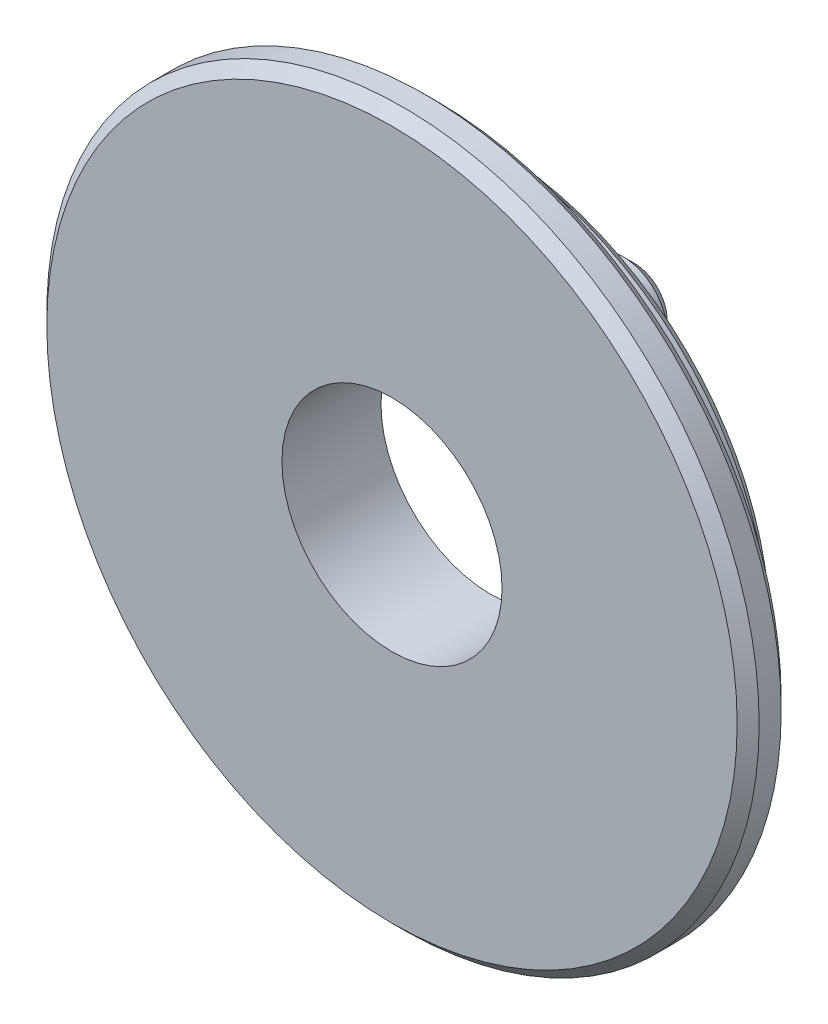
ISO-10303-21;
HEADER;
FILE_DESCRIPTION(('STEP AP214'),'2;1');
FILE_NAME('part.step','',(''),(''),'','','');
FILE_SCHEMA(('AUTOMOTIVE_DESIGN { 1 0 10303 214 1 1 1 1 }'));
ENDSEC;
DATA;
#1=APPLICATION_CONTEXT('core data for automotive mechanical design processes');
#2=APPLICATION_PROTOCOL_DEFINITION('international standard','automotive_design',2000,#1);
#3=PRODUCT_CONTEXT('',#1,'mechanical');
#4=PRODUCT('Part','Part','',(#3));
#5=PRODUCT_RELATED_PRODUCT_CATEGORY('part','',(#4));
#6=PRODUCT_DEFINITION_FORMATION('','',#4);
#7=PRODUCT_DEFINITION_CONTEXT('part definition',#1,'design');
#8=PRODUCT_DEFINITION('design','',#6,#7);
#9=PRODUCT_DEFINITION_SHAPE('','',#8);
#10=(LENGTH_UNIT() NAMED_UNIT(*) SI_UNIT(.MILLI.,.METRE.));
#11=(NAMED_UNIT(*) PLANE_ANGLE_UNIT() SI_UNIT($,.RADIAN.));
#12=(NAMED_UNIT(*) SI_UNIT($,.STERADIAN.) SOLID_ANGLE_UNIT());
#13=UNCERTAINTY_MEASURE_WITH_UNIT(LENGTH_MEASURE(1.E-05),#10,'distance_accuracy_value','');
#14=(GEOMETRIC_REPRESENTATION_CONTEXT(3) GLOBAL_UNCERTAINTY_ASSIGNED_CONTEXT((#13)) GLOBAL_UNIT_ASSIGNED_CONTEXT((#10,
#11,#12)) REPRESENTATION_CONTEXT('',''));
#15=CARTESIAN_POINT('',(0.,0.,0.));
#16=DIRECTION('',(0.,0.,1.));
#17=DIRECTION('',(1.,0.,0.));
#18=AXIS2_PLACEMENT_3D('',#15,#16,#17);
#19=CARTESIAN_POINT('',(0.,0.,-2.25));
#20=DIRECTION('',(0.,0.,-1.));
#21=DIRECTION('',(-1.,0.,0.));
#22=AXIS2_PLACEMENT_3D('',#19,#20,#21);
#23=PLANE('',#22);
#24=CARTESIAN_POINT('',(0.,0.,-2.25));
#25=DIRECTION('',(0.,0.,-1.));
#26=DIRECTION('',(-1.,0.,0.));
#27=AXIS2_PLACEMENT_3D('',#24,#25,#26);
#28=CIRCLE('',#27,6.33);
#29=CARTESIAN_POINT('',(-6.33,0.,-2.25));
#30=VERTEX_POINT('',#29);
#31=EDGE_CURVE('E10',#30,#30,#28,.T.);
#32=ORIENTED_EDGE('',*,*,#31,.T.);
#33=EDGE_LOOP('',(#32));
#34=FACE_BOUND('',#33,.T.);
#35=CARTESIAN_POINT('',(2.25000000000002,3.89711431702996,-2.25));
#36=DIRECTION('',(0.,0.,-1.));
#37=DIRECTION('',(1.,0.,0.));
#38=AXIS2_PLACEMENT_3D('',#35,#36,#37);
#39=CIRCLE('',#38,1.);
#40=CARTESIAN_POINT('',(3.25000000000002,3.89711431702996,-2.25));
#41=VERTEX_POINT('',#40);
#42=EDGE_CURVE('E85',#41,#41,#39,.T.);
#43=ORIENTED_EDGE('',*,*,#42,.F.);
#44=EDGE_LOOP('',(#43));
#45=FACE_BOUND('',#44,.T.);
#46=CARTESIAN_POINT('',(0.,0.,-2.25));
#47=DIRECTION('',(0.,0.,-1.));
#48=DIRECTION('',(-1.,0.,0.));
#49=AXIS2_PLACEMENT_3D('',#46,#47,#48);
#50=CIRCLE('',#49,2.5);
#51=CARTESIAN_POINT('',(-2.5,0.,-2.25));
#52=VERTEX_POINT('',#51);
#53=EDGE_CURVE('E76',#52,#52,#50,.T.);
#54=ORIENTED_EDGE('',*,*,#53,.F.);
#55=EDGE_LOOP('',(#54));
#56=FACE_BOUND('',#55,.T.);
#57=CARTESIAN_POINT('',(-4.5,0.,-2.25));
#58=DIRECTION('',(0.,0.,-1.));
#59=DIRECTION('',(-1.,0.,0.));
#60=AXIS2_PLACEMENT_3D('',#57,#58,#59);
#61=CIRCLE('',#60,1.);
#62=CARTESIAN_POINT('',(-5.5,0.,-2.25));
#63=VERTEX_POINT('',#62);
#64=EDGE_CURVE('E82',#63,#63,#61,.T.);
#65=ORIENTED_EDGE('',*,*,#64,.F.);
#66=EDGE_LOOP('',(#65));
#67=FACE_BOUND('',#66,.T.);
#68=CARTESIAN_POINT('',(2.25000000000002,-3.89711431702996,-2.25));
#69=DIRECTION('',(0.,0.,-1.));
#70=DIRECTION('',(-1.,0.,0.));
#71=AXIS2_PLACEMENT_3D('',#68,#69,#70);
#72=CIRCLE('',#71,1.);
#73=CARTESIAN_POINT('',(1.25000000000002,-3.89711431702996,-2.25));
#74=VERTEX_POINT('',#73);
#75=EDGE_CURVE('E88',#74,#74,#72,.T.);
#76=ORIENTED_EDGE('',*,*,#75,.F.);
#77=EDGE_LOOP('',(#76));
#78=FACE_BOUND('',#77,.T.);
#79=ADVANCED_FACE('F29',(#34,#45,#56,#67,#78),#23,.T.);
#80=CARTESIAN_POINT('',(0.,0.,17.8725165562914));
#81=DIRECTION('',(0.,0.,1.));
#82=DIRECTION('',(1.,0.,0.));
#83=AXIS2_PLACEMENT_3D('',#80,#81,#82);
#84=CYLINDRICAL_SURFACE('',#83,8.09);
#85=CARTESIAN_POINT('',(0.,0.,-0.250000000000007));
#86=DIRECTION('',(0.,0.,1.));
#87=DIRECTION('',(1.,0.,0.));
#88=AXIS2_PLACEMENT_3D('',#85,#86,#87);
#89=CIRCLE('',#88,8.09);
#90=CARTESIAN_POINT('',(8.09,0.,-0.250000000000007));
#91=VERTEX_POINT('',#90);
#92=EDGE_CURVE('E44',#91,#91,#89,.F.);
#93=ORIENTED_EDGE('',*,*,#92,.T.);
#94=EDGE_LOOP('',(#93));
#95=FACE_BOUND('',#94,.T.);
#96=CARTESIAN_POINT('',(0.,0.,-0.750000000000001));
#97=DIRECTION('',(0.,0.,-1.));
#98=DIRECTION('',(-1.,0.,0.));
#99=AXIS2_PLACEMENT_3D('',#96,#97,#98);
#100=CIRCLE('',#99,8.09);
#101=CARTESIAN_POINT('',(-8.09,0.,-0.750000000000001));
#102=VERTEX_POINT('',#101);
#103=EDGE_CURVE('E49',#102,#102,#100,.F.);
#104=ORIENTED_EDGE('',*,*,#103,.T.);
#105=EDGE_LOOP('',(#104));
#106=FACE_BOUND('',#105,.T.);
#107=ADVANCED_FACE('F95',(#95,#106),#84,.T.);
#108=CARTESIAN_POINT('',(8.09,0.,-1.));
#109=DIRECTION('',(0.,0.,-1.));
#110=DIRECTION('',(-1.,0.,0.));
#111=AXIS2_PLACEMENT_3D('',#108,#109,#110);
#112=PLANE('',#111);
#113=CARTESIAN_POINT('',(0.,0.,-1.));
#114=DIRECTION('',(0.,0.,-1.));
#115=DIRECTION('',(-1.,0.,0.));
#116=AXIS2_PLACEMENT_3D('',#113,#114,#115);
#117=CIRCLE('',#116,7.84);
#118=CARTESIAN_POINT('',(-7.84,0.,-1.));
#119=VERTEX_POINT('',#118);
#120=EDGE_CURVE('E40',#119,#119,#117,.T.);
#121=ORIENTED_EDGE('',*,*,#120,.T.);
#122=EDGE_LOOP('',(#121));
#123=FACE_BOUND('',#122,.T.);
#124=CARTESIAN_POINT('',(0.,0.,-1.));
#125=DIRECTION('',(0.,0.,1.));
#126=DIRECTION('',(1.,0.,0.));
#127=AXIS2_PLACEMENT_3D('',#124,#125,#126);
#128=CIRCLE('',#127,6.58);
#129=CARTESIAN_POINT('',(6.58,0.,-1.));
#130=VERTEX_POINT('',#129);
#131=EDGE_CURVE('E73',#130,#130,#128,.T.);
#132=ORIENTED_EDGE('',*,*,#131,.T.);
#133=EDGE_LOOP('',(#132));
#134=FACE_BOUND('',#133,.T.);
#135=ADVANCED_FACE('F100',(#123,#134),#112,.T.);
#136=CARTESIAN_POINT('',(0.,0.,17.8725165562914));
#137=DIRECTION('',(0.,0.,1.));
#138=DIRECTION('',(1.,0.,0.));
#139=AXIS2_PLACEMENT_3D('',#136,#137,#138);
#140=CYLINDRICAL_SURFACE('',#139,6.58);
#141=CARTESIAN_POINT('',(0.,0.,-1.99999999999999));
#142=DIRECTION('',(0.,0.,-1.));
#143=DIRECTION('',(-1.,0.,0.));
#144=AXIS2_PLACEMENT_3D('',#141,#142,#143);
#145=CIRCLE('',#144,6.58);
#146=CARTESIAN_POINT('',(-6.58,0.,-1.99999999999999));
#147=VERTEX_POINT('',#146);
#148=EDGE_CURVE('E36',#147,#147,#145,.F.);
#149=ORIENTED_EDGE('',*,*,#148,.T.);
#150=EDGE_LOOP('',(#149));
#151=FACE_BOUND('',#150,.T.);
#152=ORIENTED_EDGE('',*,*,#131,.F.);
#153=EDGE_LOOP('',(#152));
#154=FACE_BOUND('',#153,.T.);
#155=ADVANCED_FACE('F108',(#151,#154),#140,.T.);
#156=CARTESIAN_POINT('',(8.09,0.,0.));
#157=DIRECTION('',(0.,0.,1.));
#158=DIRECTION('',(1.,0.,0.));
#159=AXIS2_PLACEMENT_3D('',#156,#157,#158);
#160=PLANE('',#159);
#161=CARTESIAN_POINT('',(0.,0.,0.));
#162=DIRECTION('',(0.,0.,1.));
#163=DIRECTION('',(1.,0.,0.));
#164=AXIS2_PLACEMENT_3D('',#161,#162,#163);
#165=CIRCLE('',#164,7.84);
#166=CARTESIAN_POINT('',(7.84,0.,0.));
#167=VERTEX_POINT('',#166);
#168=EDGE_CURVE('E52',#167,#167,#165,.T.);
#169=ORIENTED_EDGE('',*,*,#168,.T.);
#170=EDGE_LOOP('',(#169));
#171=FACE_BOUND('',#170,.T.);
#172=CARTESIAN_POINT('',(0.,0.,0.));
#173=DIRECTION('',(0.,0.,1.));
#174=DIRECTION('',(1.,0.,0.));
#175=AXIS2_PLACEMENT_3D('',#172,#173,#174);
#176=CIRCLE('',#175,2.5);
#177=CARTESIAN_POINT('',(2.5,0.,0.));
#178=VERTEX_POINT('',#177);
#179=EDGE_CURVE('E79',#178,#178,#176,.T.);
#180=ORIENTED_EDGE('',*,*,#179,.F.);
#181=EDGE_LOOP('',(#180));
#182=FACE_BOUND('',#181,.T.);
#183=ADVANCED_FACE('F106',(#171,#182),#160,.T.);
#184=CARTESIAN_POINT('',(0.,0.,0.));
#185=DIRECTION('',(0.,0.,1.));
#186=DIRECTION('',(1.,0.,0.));
#187=AXIS2_PLACEMENT_3D('',#184,#185,#186);
#188=CYLINDRICAL_SURFACE('',#187,2.5);
#189=ORIENTED_EDGE('',*,*,#53,.T.);
#190=EDGE_LOOP('',(#189));
#191=FACE_BOUND('',#190,.T.);
#192=ORIENTED_EDGE('',*,*,#179,.T.);
#193=EDGE_LOOP('',(#192));
#194=FACE_BOUND('',#193,.T.);
#195=ADVANCED_FACE('F233',(#191,#194),#188,.F.);
#196=CARTESIAN_POINT('',(-4.5,0.,-3.25));
#197=DIRECTION('',(0.,0.,1.));
#198=DIRECTION('',(1.,0.,0.));
#199=AXIS2_PLACEMENT_3D('',#196,#197,#198);
#200=CYLINDRICAL_SURFACE('',#199,1.);
#201=CARTESIAN_POINT('',(-4.5,0.,-3.));
#202=DIRECTION('',(0.,0.,-1.));
#203=DIRECTION('',(-1.,0.,0.));
#204=AXIS2_PLACEMENT_3D('',#201,#202,#203);
#205=CIRCLE('',#204,1.);
#206=CARTESIAN_POINT('',(-5.5,0.,-3.));
#207=VERTEX_POINT('',#206);
#208=EDGE_CURVE('E67',#207,#207,#205,.F.);
#209=ORIENTED_EDGE('',*,*,#208,.T.);
#210=EDGE_LOOP('',(#209));
#211=FACE_BOUND('',#210,.T.);
#212=ORIENTED_EDGE('',*,*,#64,.T.);
#213=EDGE_LOOP('',(#212));
#214=FACE_BOUND('',#213,.T.);
#215=ADVANCED_FACE('F223',(#211,#214),#200,.T.);
#216=CARTESIAN_POINT('',(-4.5,0.,-3.25));
#217=DIRECTION('',(0.,0.,-1.));
#218=DIRECTION('',(-1.,0.,0.));
#219=AXIS2_PLACEMENT_3D('',#216,#217,#218);
#220=PLANE('',#219);
#221=CARTESIAN_POINT('',(-4.5,0.,-3.25));
#222=DIRECTION('',(0.,0.,-1.));
#223=DIRECTION('',(-1.,0.,0.));
#224=AXIS2_PLACEMENT_3D('',#221,#222,#223);
#225=CIRCLE('',#224,0.750000000000001);
#226=CARTESIAN_POINT('',(-5.25,0.,-3.25));
#227=VERTEX_POINT('',#226);
#228=EDGE_CURVE('E70',#227,#227,#225,.T.);
#229=ORIENTED_EDGE('',*,*,#228,.T.);
#230=EDGE_LOOP('',(#229));
#231=FACE_BOUND('',#230,.T.);
#232=ADVANCED_FACE('F213',(#231),#220,.T.);
#233=CARTESIAN_POINT('',(2.25000000000002,3.89711431702996,-3.25));
#234=DIRECTION('',(0.,0.,1.));
#235=DIRECTION('',(1.,0.,0.));
#236=AXIS2_PLACEMENT_3D('',#233,#234,#235);
#237=CYLINDRICAL_SURFACE('',#236,1.);
#238=CARTESIAN_POINT('',(2.25000000000002,3.89711431702996,-3.));
#239=DIRECTION('',(0.,0.,1.));
#240=DIRECTION('',(1.,0.,0.));
#241=AXIS2_PLACEMENT_3D('',#238,#239,#240);
#242=CIRCLE('',#241,1.);
#243=CARTESIAN_POINT('',(3.25000000000002,3.89711431702996,-3.));
#244=VERTEX_POINT('',#243);
#245=EDGE_CURVE('E55',#244,#244,#242,.T.);
#246=ORIENTED_EDGE('',*,*,#245,.T.);
#247=EDGE_LOOP('',(#246));
#248=FACE_BOUND('',#247,.T.);
#249=ORIENTED_EDGE('',*,*,#42,.T.);
#250=EDGE_LOOP('',(#249));
#251=FACE_BOUND('',#250,.T.);
#252=ADVANCED_FACE('F203',(#248,#251),#237,.T.);
#253=CARTESIAN_POINT('',(2.25000000000002,3.89711431702996,-3.25));
#254=DIRECTION('',(0.,0.,1.));
#255=DIRECTION('',(1.,0.,0.));
#256=AXIS2_PLACEMENT_3D('',#253,#254,#255);
#257=PLANE('',#256);
#258=CARTESIAN_POINT('',(2.25000000000002,3.89711431702996,-3.25));
#259=DIRECTION('',(0.,0.,1.));
#260=DIRECTION('',(1.,0.,0.));
#261=AXIS2_PLACEMENT_3D('',#258,#259,#260);
#262=CIRCLE('',#261,0.749999999999997);
#263=CARTESIAN_POINT('',(3.00000000000002,3.89711431702996,-3.25));
#264=VERTEX_POINT('',#263);
#265=EDGE_CURVE('E58',#264,#264,#262,.F.);
#266=ORIENTED_EDGE('',*,*,#265,.T.);
#267=EDGE_LOOP('',(#266));
#268=FACE_BOUND('',#267,.T.);
#269=ADVANCED_FACE('F193',(#268),#257,.F.);
#270=CARTESIAN_POINT('',(2.25000000000002,-3.89711431702996,-3.25));
#271=DIRECTION('',(0.,0.,1.));
#272=DIRECTION('',(1.,0.,0.));
#273=AXIS2_PLACEMENT_3D('',#270,#271,#272);
#274=CYLINDRICAL_SURFACE('',#273,1.);
#275=CARTESIAN_POINT('',(2.25000000000002,-3.89711431702996,-3.));
#276=DIRECTION('',(0.,0.,-1.));
#277=DIRECTION('',(-1.,0.,0.));
#278=AXIS2_PLACEMENT_3D('',#275,#276,#277);
#279=CIRCLE('',#278,1.);
#280=CARTESIAN_POINT('',(1.25000000000002,-3.89711431702996,-3.));
#281=VERTEX_POINT('',#280);
#282=EDGE_CURVE('E61',#281,#281,#279,.F.);
#283=ORIENTED_EDGE('',*,*,#282,.T.);
#284=EDGE_LOOP('',(#283));
#285=FACE_BOUND('',#284,.T.);
#286=ORIENTED_EDGE('',*,*,#75,.T.);
#287=EDGE_LOOP('',(#286));
#288=FACE_BOUND('',#287,.T.);
#289=ADVANCED_FACE('F92',(#285,#288),#274,.T.);
#290=CARTESIAN_POINT('',(2.25000000000002,-3.89711431702996,-3.25));
#291=DIRECTION('',(0.,0.,-1.));
#292=DIRECTION('',(-1.,0.,0.));
#293=AXIS2_PLACEMENT_3D('',#290,#291,#292);
#294=PLANE('',#293);
#295=CARTESIAN_POINT('',(2.25000000000002,-3.89711431702996,-3.25));
#296=DIRECTION('',(0.,0.,-1.));
#297=DIRECTION('',(-1.,0.,0.));
#298=AXIS2_PLACEMENT_3D('',#295,#296,#297);
#299=CIRCLE('',#298,0.750000000000001);
#300=CARTESIAN_POINT('',(1.50000000000002,-3.89711431702996,-3.25));
#301=VERTEX_POINT('',#300);
#302=EDGE_CURVE('E64',#301,#301,#299,.T.);
#303=ORIENTED_EDGE('',*,*,#302,.T.);
#304=EDGE_LOOP('',(#303));
#305=FACE_BOUND('',#304,.T.);
#306=ADVANCED_FACE('F118',(#305),#294,.T.);
#307=CARTESIAN_POINT('',(-4.5,0.,-3.25));
#308=DIRECTION('',(0.,0.,1.));
#309=DIRECTION('',(1.,0.,0.));
#310=AXIS2_PLACEMENT_3D('',#307,#308,#309);
#311=CONICAL_SURFACE('',#310,0.750000000000001,0.785398163397449);
#312=ORIENTED_EDGE('',*,*,#208,.F.);
#313=EDGE_LOOP('',(#312));
#314=FACE_BOUND('',#313,.T.);
#315=ORIENTED_EDGE('',*,*,#228,.F.);
#316=EDGE_LOOP('',(#315));
#317=FACE_BOUND('',#316,.T.);
#318=ADVANCED_FACE('F114',(#314,#317),#311,.T.);
#319=CARTESIAN_POINT('',(2.25000000000002,-3.89711431702996,-3.25));
#320=DIRECTION('',(0.,0.,1.));
#321=DIRECTION('',(1.,0.,0.));
#322=AXIS2_PLACEMENT_3D('',#319,#320,#321);
#323=CONICAL_SURFACE('',#322,0.750000000000001,0.785398163397449);
#324=ORIENTED_EDGE('',*,*,#282,.F.);
#325=EDGE_LOOP('',(#324));
#326=FACE_BOUND('',#325,.T.);
#327=ORIENTED_EDGE('',*,*,#302,.F.);
#328=EDGE_LOOP('',(#327));
#329=FACE_BOUND('',#328,.T.);
#330=ADVANCED_FACE('F117',(#326,#329),#323,.T.);
#331=CARTESIAN_POINT('',(2.25000000000002,3.89711431702996,-3.25));
#332=DIRECTION('',(0.,0.,1.));
#333=DIRECTION('',(1.,0.,0.));
#334=AXIS2_PLACEMENT_3D('',#331,#332,#333);
#335=CONICAL_SURFACE('',#334,0.749999999999997,0.785398163397449);
#336=ORIENTED_EDGE('',*,*,#245,.F.);
#337=EDGE_LOOP('',(#336));
#338=FACE_BOUND('',#337,.T.);
#339=ORIENTED_EDGE('',*,*,#265,.F.);
#340=EDGE_LOOP('',(#339));
#341=FACE_BOUND('',#340,.T.);
#342=ADVANCED_FACE('F122',(#338,#341),#335,.T.);
#343=CARTESIAN_POINT('',(0.,0.,0.));
#344=DIRECTION('',(0.,0.,-1.));
#345=DIRECTION('',(-1.,0.,0.));
#346=AXIS2_PLACEMENT_3D('',#343,#344,#345);
#347=CONICAL_SURFACE('',#346,7.84,0.785398163397434);
#348=ORIENTED_EDGE('',*,*,#92,.F.);
#349=EDGE_LOOP('',(#348));
#350=FACE_BOUND('',#349,.T.);
#351=ORIENTED_EDGE('',*,*,#168,.F.);
#352=EDGE_LOOP('',(#351));
#353=FACE_BOUND('',#352,.T.);
#354=ADVANCED_FACE('F126',(#350,#353),#347,.T.);
#355=CARTESIAN_POINT('',(0.,0.,-0.750000000000001));
#356=DIRECTION('',(0.,0.,1.));
#357=DIRECTION('',(1.,0.,0.));
#358=AXIS2_PLACEMENT_3D('',#355,#356,#357);
#359=CONICAL_SURFACE('',#358,8.09,0.785398163397445);
#360=ORIENTED_EDGE('',*,*,#120,.F.);
#361=EDGE_LOOP('',(#360));
#362=FACE_BOUND('',#361,.T.);
#363=ORIENTED_EDGE('',*,*,#103,.F.);
#364=EDGE_LOOP('',(#363));
#365=FACE_BOUND('',#364,.T.);
#366=ADVANCED_FACE('F129',(#362,#365),#359,.T.);
#367=CARTESIAN_POINT('',(0.,0.,-1.99999999999999));
#368=DIRECTION('',(0.,0.,1.));
#369=DIRECTION('',(1.,0.,0.));
#370=AXIS2_PLACEMENT_3D('',#367,#368,#369);
#371=CONICAL_SURFACE('',#370,6.58,0.785398163397441);
#372=ORIENTED_EDGE('',*,*,#31,.F.);
#373=EDGE_LOOP('',(#372));
#374=FACE_BOUND('',#373,.T.);
#375=ORIENTED_EDGE('',*,*,#148,.F.);
#376=EDGE_LOOP('',(#375));
#377=FACE_BOUND('',#376,.T.);
#378=ADVANCED_FACE('F31',(#374,#377),#371,.T.);
#379=CLOSED_SHELL('',(#79,#107,#135,#155,#183,#195,#215,#232,#252,#269,#289,#306,#318,#330,#342,
#354,#366,#378));
#380=MANIFOLD_SOLID_BREP('B2',#379);
#381=ADVANCED_BREP_SHAPE_REPRESENTATION('',(#18,#380),#14);
#382=SHAPE_DEFINITION_REPRESENTATION(#9,#381);
ENDSEC;
END-ISO-10303-21;
